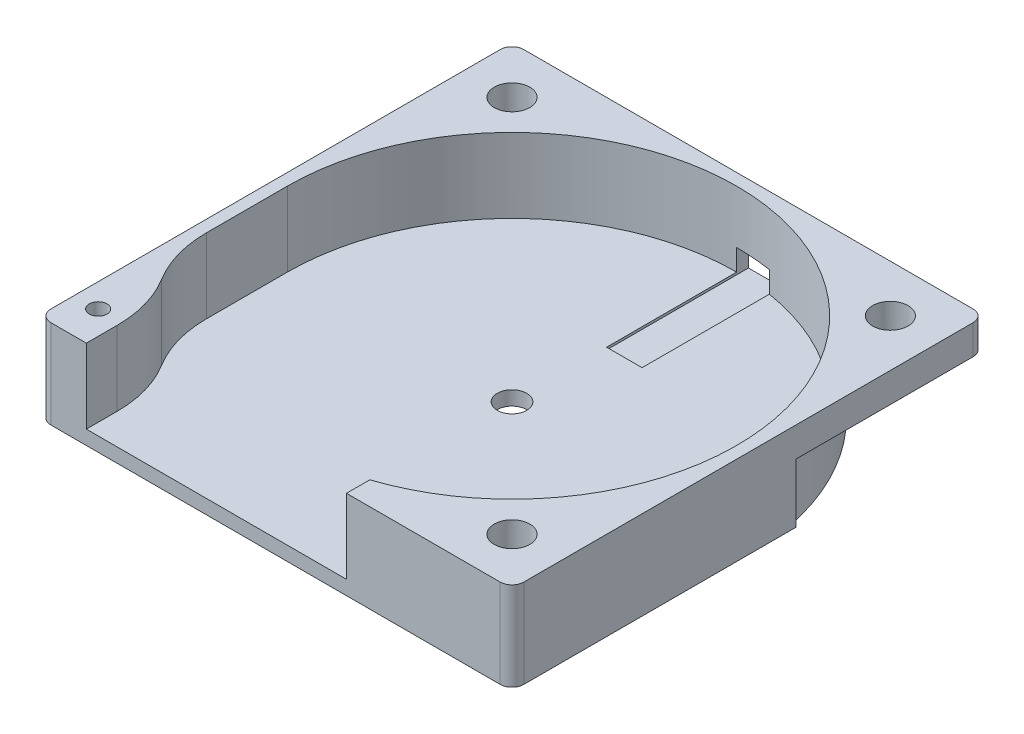
ISO-10303-21;
HEADER;
FILE_DESCRIPTION(('STEP AP214'),'2;1');
FILE_NAME('part.step','',(''),(''),'','','');
FILE_SCHEMA(('AUTOMOTIVE_DESIGN { 1 0 10303 214 1 1 1 1 }'));
ENDSEC;
DATA;
#1=APPLICATION_CONTEXT('core data for automotive mechanical design processes');
#2=APPLICATION_PROTOCOL_DEFINITION('international standard','automotive_design',2000,#1);
#3=PRODUCT_CONTEXT('',#1,'mechanical');
#4=PRODUCT('Part','Part','',(#3));
#5=PRODUCT_RELATED_PRODUCT_CATEGORY('part','',(#4));
#6=PRODUCT_DEFINITION_FORMATION('','',#4);
#7=PRODUCT_DEFINITION_CONTEXT('part definition',#1,'design');
#8=PRODUCT_DEFINITION('design','',#6,#7);
#9=PRODUCT_DEFINITION_SHAPE('','',#8);
#10=(LENGTH_UNIT() NAMED_UNIT(*) SI_UNIT(.MILLI.,.METRE.));
#11=(NAMED_UNIT(*) PLANE_ANGLE_UNIT() SI_UNIT($,.RADIAN.));
#12=(NAMED_UNIT(*) SI_UNIT($,.STERADIAN.) SOLID_ANGLE_UNIT());
#13=UNCERTAINTY_MEASURE_WITH_UNIT(LENGTH_MEASURE(1.E-05),#10,'distance_accuracy_value','');
#14=(GEOMETRIC_REPRESENTATION_CONTEXT(3) GLOBAL_UNCERTAINTY_ASSIGNED_CONTEXT((#13)) GLOBAL_UNIT_ASSIGNED_CONTEXT((#10,
#11,#12)) REPRESENTATION_CONTEXT('',''));
#15=CARTESIAN_POINT('',(0.,0.,0.));
#16=DIRECTION('',(0.,0.,1.));
#17=DIRECTION('',(1.,0.,0.));
#18=AXIS2_PLACEMENT_3D('',#15,#16,#17);
#19=CARTESIAN_POINT('',(-20.,7.5,-20.));
#20=DIRECTION('',(0.,0.,1.));
#21=DIRECTION('',(1.,0.,0.));
#22=AXIS2_PLACEMENT_3D('',#19,#20,#21);
#23=PLANE('',#22);
#24=DIRECTION('',(1.,0.,0.));
#25=VECTOR('',#24,1.);
#26=CARTESIAN_POINT('',(0.,3.,-20.));
#27=LINE('',#26,#25);
#28=CARTESIAN_POINT('',(0.,3.,-20.));
#29=VERTEX_POINT('',#28);
#30=CARTESIAN_POINT('',(3.,3.,-20.));
#31=VERTEX_POINT('',#30);
#32=EDGE_CURVE('E321',#29,#31,#27,.T.);
#33=ORIENTED_EDGE('',*,*,#32,.F.);
#34=DIRECTION('',(0.,-1.,0.));
#35=VECTOR('',#34,1.);
#36=CARTESIAN_POINT('',(0.,3.,-20.));
#37=LINE('',#36,#35);
#38=CARTESIAN_POINT('',(0.,1.,-20.));
#39=VERTEX_POINT('',#38);
#40=EDGE_CURVE('E327',#29,#39,#37,.T.);
#41=ORIENTED_EDGE('',*,*,#40,.T.);
#42=DIRECTION('',(1.,0.,0.));
#43=VECTOR('',#42,1.);
#44=CARTESIAN_POINT('',(0.,1.,-20.));
#45=LINE('',#44,#43);
#46=CARTESIAN_POINT('',(3.,1.,-20.));
#47=VERTEX_POINT('',#46);
#48=EDGE_CURVE('E330',#39,#47,#45,.T.);
#49=ORIENTED_EDGE('',*,*,#48,.T.);
#50=DIRECTION('',(0.,-1.,0.));
#51=VECTOR('',#50,1.);
#52=CARTESIAN_POINT('',(3.,3.,-20.));
#53=LINE('',#52,#51);
#54=EDGE_CURVE('E343',#31,#47,#53,.T.);
#55=ORIENTED_EDGE('',*,*,#54,.F.);
#56=EDGE_LOOP('',(#33,#41,#49,#55));
#57=FACE_BOUND('',#56,.T.);
#58=DIRECTION('',(0.,-1.,0.));
#59=VECTOR('',#58,1.);
#60=CARTESIAN_POINT('',(4.,5.,-20.));
#61=LINE('',#60,#59);
#62=CARTESIAN_POINT('',(4.,5.,-20.));
#63=VERTEX_POINT('',#62);
#64=CARTESIAN_POINT('',(4.,0.,-20.));
#65=VERTEX_POINT('',#64);
#66=EDGE_CURVE('E238',#63,#65,#61,.T.);
#67=ORIENTED_EDGE('',*,*,#66,.T.);
#68=DIRECTION('',(-1.,0.,0.));
#69=VECTOR('',#68,1.);
#70=CARTESIAN_POINT('',(-20.,0.,-20.));
#71=LINE('',#70,#69);
#72=CARTESIAN_POINT('',(-4.,0.,-20.));
#73=VERTEX_POINT('',#72);
#74=EDGE_CURVE('E418',#65,#73,#71,.T.);
#75=ORIENTED_EDGE('',*,*,#74,.T.);
#76=DIRECTION('',(0.,-1.,0.));
#77=VECTOR('',#76,1.);
#78=CARTESIAN_POINT('',(-4.,5.,-20.));
#79=LINE('',#78,#77);
#80=CARTESIAN_POINT('',(-4.,5.,-20.));
#81=VERTEX_POINT('',#80);
#82=EDGE_CURVE('E304',#81,#73,#79,.T.);
#83=ORIENTED_EDGE('',*,*,#82,.F.);
#84=DIRECTION('',(1.,0.,0.));
#85=VECTOR('',#84,1.);
#86=CARTESIAN_POINT('',(0.,5.,-20.));
#87=LINE('',#86,#85);
#88=CARTESIAN_POINT('',(-19.,5.,-20.));
#89=VERTEX_POINT('',#88);
#90=EDGE_CURVE('E287',#89,#81,#87,.T.);
#91=ORIENTED_EDGE('',*,*,#90,.F.);
#92=DIRECTION('',(0.,-1.,0.));
#93=VECTOR('',#92,1.);
#94=CARTESIAN_POINT('',(-19.,7.5,-20.));
#95=LINE('',#94,#93);
#96=CARTESIAN_POINT('',(-19.,7.5,-20.));
#97=VERTEX_POINT('',#96);
#98=EDGE_CURVE('E469',#89,#97,#95,.F.);
#99=ORIENTED_EDGE('',*,*,#98,.T.);
#100=DIRECTION('',(-1.,0.,0.));
#101=VECTOR('',#100,1.);
#102=CARTESIAN_POINT('',(-20.,7.5,-20.));
#103=LINE('',#102,#101);
#104=CARTESIAN_POINT('',(19.,7.5,-20.));
#105=VERTEX_POINT('',#104);
#106=EDGE_CURVE('E405',#105,#97,#103,.T.);
#107=ORIENTED_EDGE('',*,*,#106,.F.);
#108=DIRECTION('',(0.,-1.,0.));
#109=VECTOR('',#108,1.);
#110=CARTESIAN_POINT('',(19.,7.5,-20.));
#111=LINE('',#110,#109);
#112=CARTESIAN_POINT('',(19.,5.,-20.));
#113=VERTEX_POINT('',#112);
#114=EDGE_CURVE('E466',#105,#113,#111,.T.);
#115=ORIENTED_EDGE('',*,*,#114,.T.);
#116=DIRECTION('',(1.,0.,0.));
#117=VECTOR('',#116,1.);
#118=CARTESIAN_POINT('',(0.,5.,-20.));
#119=LINE('',#118,#117);
#120=EDGE_CURVE('E64',#63,#113,#119,.T.);
#121=ORIENTED_EDGE('',*,*,#120,.F.);
#122=EDGE_LOOP('',(#67,#75,#83,#91,#99,#107,#115,#121));
#123=FACE_BOUND('',#122,.T.);
#124=ADVANCED_FACE('F41',(#57,#123),#23,.F.);
#125=CARTESIAN_POINT('',(20.,7.5,20.));
#126=DIRECTION('',(-1.,0.,0.));
#127=DIRECTION('',(0.,0.,1.));
#128=AXIS2_PLACEMENT_3D('',#125,#126,#127);
#129=PLANE('',#128);
#130=DIRECTION('',(0.,-1.,0.));
#131=VECTOR('',#130,1.);
#132=CARTESIAN_POINT('',(20.,5.,-3.99999999999999));
#133=LINE('',#132,#131);
#134=CARTESIAN_POINT('',(20.,5.,-3.99999999999999));
#135=VERTEX_POINT('',#134);
#136=CARTESIAN_POINT('',(20.,0.,-3.99999999999999));
#137=VERTEX_POINT('',#136);
#138=EDGE_CURVE('E276',#135,#137,#133,.T.);
#139=ORIENTED_EDGE('',*,*,#138,.F.);
#140=DIRECTION('',(0.,0.,1.));
#141=VECTOR('',#140,1.);
#142=CARTESIAN_POINT('',(20.,5.,0.));
#143=LINE('',#142,#141);
#144=CARTESIAN_POINT('',(20.,5.,-19.));
#145=VERTEX_POINT('',#144);
#146=EDGE_CURVE('E265',#145,#135,#143,.T.);
#147=ORIENTED_EDGE('',*,*,#146,.F.);
#148=DIRECTION('',(0.,-1.,0.));
#149=VECTOR('',#148,1.);
#150=CARTESIAN_POINT('',(20.,7.5,-19.));
#151=LINE('',#150,#149);
#152=CARTESIAN_POINT('',(20.,7.5,-19.));
#153=VERTEX_POINT('',#152);
#154=EDGE_CURVE('E474',#145,#153,#151,.F.);
#155=ORIENTED_EDGE('',*,*,#154,.T.);
#156=DIRECTION('',(0.,0.,-1.));
#157=VECTOR('',#156,1.);
#158=CARTESIAN_POINT('',(20.,7.5,20.));
#159=LINE('',#158,#157);
#160=CARTESIAN_POINT('',(20.,7.5,19.));
#161=VERTEX_POINT('',#160);
#162=EDGE_CURVE('E402',#161,#153,#159,.T.);
#163=ORIENTED_EDGE('',*,*,#162,.F.);
#164=DIRECTION('',(0.,-1.,0.));
#165=VECTOR('',#164,1.);
#166=CARTESIAN_POINT('',(20.,7.5,19.));
#167=LINE('',#166,#165);
#168=CARTESIAN_POINT('',(20.,0.,19.));
#169=VERTEX_POINT('',#168);
#170=EDGE_CURVE('E471',#161,#169,#167,.T.);
#171=ORIENTED_EDGE('',*,*,#170,.T.);
#172=DIRECTION('',(0.,0.,-1.));
#173=VECTOR('',#172,1.);
#174=CARTESIAN_POINT('',(20.,0.,20.));
#175=LINE('',#174,#173);
#176=EDGE_CURVE('E401',#169,#137,#175,.T.);
#177=ORIENTED_EDGE('',*,*,#176,.T.);
#178=EDGE_LOOP('',(#139,#147,#155,#163,#171,#177));
#179=FACE_BOUND('',#178,.T.);
#180=ADVANCED_FACE('F552',(#179),#129,.F.);
#181=CARTESIAN_POINT('',(0.,0.,0.));
#182=DIRECTION('',(0.,-1.,0.));
#183=DIRECTION('',(0.,0.,-1.));
#184=AXIS2_PLACEMENT_3D('',#181,#182,#183);
#185=PLANE('',#184);
#186=CARTESIAN_POINT('',(16.,0.,16.));
#187=DIRECTION('',(0.,1.,0.));
#188=DIRECTION('',(0.,0.,1.));
#189=AXIS2_PLACEMENT_3D('',#186,#187,#188);
#190=CIRCLE('',#189,1.5);
#191=CARTESIAN_POINT('',(16.,0.,17.5));
#192=VERTEX_POINT('',#191);
#193=EDGE_CURVE('E378',#192,#192,#190,.T.);
#194=ORIENTED_EDGE('',*,*,#193,.T.);
#195=EDGE_LOOP('',(#194));
#196=FACE_BOUND('',#195,.T.);
#197=CARTESIAN_POINT('',(0.,0.,0.));
#198=DIRECTION('',(0.,1.,0.));
#199=DIRECTION('',(0.,0.,1.));
#200=AXIS2_PLACEMENT_3D('',#197,#198,#199);
#201=CIRCLE('',#200,1.25);
#202=CARTESIAN_POINT('',(0.,0.,1.25));
#203=VERTEX_POINT('',#202);
#204=EDGE_CURVE('E365',#203,#203,#201,.T.);
#205=ORIENTED_EDGE('',*,*,#204,.T.);
#206=EDGE_LOOP('',(#205));
#207=FACE_BOUND('',#206,.T.);
#208=CARTESIAN_POINT('',(-18.,0.,17.));
#209=DIRECTION('',(0.,1.,0.));
#210=DIRECTION('',(0.,0.,1.));
#211=AXIS2_PLACEMENT_3D('',#208,#209,#210);
#212=CIRCLE('',#211,0.750000000000002);
#213=CARTESIAN_POINT('',(-18.,0.,17.75));
#214=VERTEX_POINT('',#213);
#215=EDGE_CURVE('E354',#214,#214,#212,.T.);
#216=ORIENTED_EDGE('',*,*,#215,.T.);
#217=EDGE_LOOP('',(#216));
#218=FACE_BOUND('',#217,.T.);
#219=CARTESIAN_POINT('',(0.,0.,0.));
#220=DIRECTION('',(0.,-1.,0.));
#221=DIRECTION('',(0.,0.,-1.));
#222=AXIS2_PLACEMENT_3D('',#219,#220,#221);
#223=CIRCLE('',#222,20.);
#224=CARTESIAN_POINT('',(4.,0.,-19.5959179422654));
#225=VERTEX_POINT('',#224);
#226=CARTESIAN_POINT('',(19.5959179422654,0.,-3.99999999999999));
#227=VERTEX_POINT('',#226);
#228=EDGE_CURVE('E248',#225,#227,#223,.T.);
#229=ORIENTED_EDGE('',*,*,#228,.T.);
#230=DIRECTION('',(1.,0.,0.));
#231=VECTOR('',#230,1.);
#232=CARTESIAN_POINT('',(0.,0.,-4.00000000000002));
#233=LINE('',#232,#231);
#234=EDGE_CURVE('E256',#227,#137,#233,.T.);
#235=ORIENTED_EDGE('',*,*,#234,.T.);
#236=ORIENTED_EDGE('',*,*,#176,.F.);
#237=CARTESIAN_POINT('',(19.,0.,19.));
#238=DIRECTION('',(0.,-1.,0.));
#239=DIRECTION('',(0.,0.,-1.));
#240=AXIS2_PLACEMENT_3D('',#237,#238,#239);
#241=CIRCLE('',#240,1.);
#242=CARTESIAN_POINT('',(19.,0.,20.));
#243=VERTEX_POINT('',#242);
#244=EDGE_CURVE('E448',#169,#243,#241,.T.);
#245=ORIENTED_EDGE('',*,*,#244,.T.);
#246=DIRECTION('',(1.,0.,0.));
#247=VECTOR('',#246,1.);
#248=CARTESIAN_POINT('',(-20.,0.,20.));
#249=LINE('',#248,#247);
#250=CARTESIAN_POINT('',(-19.,0.,20.));
#251=VERTEX_POINT('',#250);
#252=EDGE_CURVE('E406',#251,#243,#249,.T.);
#253=ORIENTED_EDGE('',*,*,#252,.F.);
#254=CARTESIAN_POINT('',(-19.,0.,19.));
#255=DIRECTION('',(0.,-1.,0.));
#256=DIRECTION('',(0.,0.,-1.));
#257=AXIS2_PLACEMENT_3D('',#254,#255,#256);
#258=CIRCLE('',#257,1.);
#259=CARTESIAN_POINT('',(-20.,0.,19.));
#260=VERTEX_POINT('',#259);
#261=EDGE_CURVE('E450',#251,#260,#258,.T.);
#262=ORIENTED_EDGE('',*,*,#261,.T.);
#263=DIRECTION('',(0.,0.,1.));
#264=VECTOR('',#263,1.);
#265=CARTESIAN_POINT('',(-20.,0.,20.));
#266=LINE('',#265,#264);
#267=CARTESIAN_POINT('',(-20.,0.,-3.99999999999999));
#268=VERTEX_POINT('',#267);
#269=EDGE_CURVE('E421',#268,#260,#266,.T.);
#270=ORIENTED_EDGE('',*,*,#269,.F.);
#271=DIRECTION('',(-1.,0.,0.));
#272=VECTOR('',#271,1.);
#273=CARTESIAN_POINT('',(0.,0.,-4.00000000000002));
#274=LINE('',#273,#272);
#275=CARTESIAN_POINT('',(-19.5959179422654,0.,-3.99999999999999));
#276=VERTEX_POINT('',#275);
#277=EDGE_CURVE('E299',#276,#268,#274,.T.);
#278=ORIENTED_EDGE('',*,*,#277,.F.);
#279=CARTESIAN_POINT('',(0.,0.,0.));
#280=DIRECTION('',(0.,-1.,0.));
#281=DIRECTION('',(0.,0.,-1.));
#282=AXIS2_PLACEMENT_3D('',#279,#280,#281);
#283=CIRCLE('',#282,20.);
#284=CARTESIAN_POINT('',(-4.,0.,-19.5959179422654));
#285=VERTEX_POINT('',#284);
#286=EDGE_CURVE('E296',#276,#285,#283,.T.);
#287=ORIENTED_EDGE('',*,*,#286,.T.);
#288=DIRECTION('',(0.,0.,1.));
#289=VECTOR('',#288,1.);
#290=CARTESIAN_POINT('',(-4.00000000000005,0.,0.));
#291=LINE('',#290,#289);
#292=EDGE_CURVE('E282',#73,#285,#291,.T.);
#293=ORIENTED_EDGE('',*,*,#292,.F.);
#294=ORIENTED_EDGE('',*,*,#74,.F.);
#295=DIRECTION('',(0.,0.,1.));
#296=VECTOR('',#295,1.);
#297=CARTESIAN_POINT('',(4.,0.,0.));
#298=LINE('',#297,#296);
#299=EDGE_CURVE('E259',#65,#225,#298,.T.);
#300=ORIENTED_EDGE('',*,*,#299,.T.);
#301=EDGE_LOOP('',(#229,#235,#236,#245,#253,#262,#270,#278,#287,#293,#294,#300));
#302=FACE_BOUND('',#301,.T.);
#303=ADVANCED_FACE('F554',(#196,#207,#218,#302),#185,.T.);
#304=CARTESIAN_POINT('',(16.,0.,-16.));
#305=DIRECTION('',(0.,1.,0.));
#306=DIRECTION('',(0.,0.,1.));
#307=AXIS2_PLACEMENT_3D('',#304,#305,#306);
#308=CYLINDRICAL_SURFACE('',#307,1.5);
#309=CARTESIAN_POINT('',(16.,7.5,-16.));
#310=DIRECTION('',(0.,1.,0.));
#311=DIRECTION('',(0.,0.,1.));
#312=AXIS2_PLACEMENT_3D('',#309,#310,#311);
#313=CIRCLE('',#312,1.5);
#314=CARTESIAN_POINT('',(16.,7.5,-14.5));
#315=VERTEX_POINT('',#314);
#316=EDGE_CURVE('E375',#315,#315,#313,.T.);
#317=ORIENTED_EDGE('',*,*,#316,.T.);
#318=EDGE_LOOP('',(#317));
#319=FACE_BOUND('',#318,.T.);
#320=CARTESIAN_POINT('',(16.,5.,-16.));
#321=DIRECTION('',(0.,-1.,0.));
#322=DIRECTION('',(0.,0.,-1.));
#323=AXIS2_PLACEMENT_3D('',#320,#321,#322);
#324=CIRCLE('',#323,1.5);
#325=CARTESIAN_POINT('',(16.,5.,-17.5));
#326=VERTEX_POINT('',#325);
#327=EDGE_CURVE('E250',#326,#326,#324,.F.);
#328=ORIENTED_EDGE('',*,*,#327,.F.);
#329=EDGE_LOOP('',(#328));
#330=FACE_BOUND('',#329,.T.);
#331=ADVANCED_FACE('F601',(#319,#330),#308,.F.);
#332=CARTESIAN_POINT('',(-16.,0.,-16.));
#333=DIRECTION('',(0.,1.,0.));
#334=DIRECTION('',(0.,0.,1.));
#335=AXIS2_PLACEMENT_3D('',#332,#333,#334);
#336=CYLINDRICAL_SURFACE('',#335,1.5);
#337=CARTESIAN_POINT('',(-16.,7.5,-16.));
#338=DIRECTION('',(0.,1.,0.));
#339=DIRECTION('',(0.,0.,1.));
#340=AXIS2_PLACEMENT_3D('',#337,#338,#339);
#341=CIRCLE('',#340,1.5);
#342=CARTESIAN_POINT('',(-16.,7.5,-14.5));
#343=VERTEX_POINT('',#342);
#344=EDGE_CURVE('E371',#343,#343,#341,.T.);
#345=ORIENTED_EDGE('',*,*,#344,.T.);
#346=EDGE_LOOP('',(#345));
#347=FACE_BOUND('',#346,.T.);
#348=CARTESIAN_POINT('',(-16.,5.,-16.));
#349=DIRECTION('',(0.,-1.,0.));
#350=DIRECTION('',(0.,0.,-1.));
#351=AXIS2_PLACEMENT_3D('',#348,#349,#350);
#352=CIRCLE('',#351,1.5);
#353=CARTESIAN_POINT('',(-16.,5.,-17.5));
#354=VERTEX_POINT('',#353);
#355=EDGE_CURVE('E292',#354,#354,#352,.F.);
#356=ORIENTED_EDGE('',*,*,#355,.F.);
#357=EDGE_LOOP('',(#356));
#358=FACE_BOUND('',#357,.T.);
#359=ADVANCED_FACE('F599',(#347,#358),#336,.F.);
#360=CARTESIAN_POINT('',(-19.,7.5,-19.));
#361=DIRECTION('',(0.,-1.,0.));
#362=DIRECTION('',(0.,0.,-1.));
#363=AXIS2_PLACEMENT_3D('',#360,#361,#362);
#364=CYLINDRICAL_SURFACE('',#363,1.);
#365=ORIENTED_EDGE('',*,*,#98,.F.);
#366=CARTESIAN_POINT('',(-19.,5.,-19.));
#367=DIRECTION('',(0.,-1.,0.));
#368=DIRECTION('',(0.,0.,-1.));
#369=AXIS2_PLACEMENT_3D('',#366,#367,#368);
#370=CIRCLE('',#369,1.);
#371=CARTESIAN_POINT('',(-20.,5.,-19.));
#372=VERTEX_POINT('',#371);
#373=EDGE_CURVE('E285',#372,#89,#370,.T.);
#374=ORIENTED_EDGE('',*,*,#373,.F.);
#375=DIRECTION('',(0.,-1.,0.));
#376=VECTOR('',#375,1.);
#377=CARTESIAN_POINT('',(-20.,7.5,-19.));
#378=LINE('',#377,#376);
#379=CARTESIAN_POINT('',(-20.,7.5,-19.));
#380=VERTEX_POINT('',#379);
#381=EDGE_CURVE('E453',#380,#372,#378,.T.);
#382=ORIENTED_EDGE('',*,*,#381,.F.);
#383=CARTESIAN_POINT('',(-19.,7.5,-19.));
#384=DIRECTION('',(0.,-1.,0.));
#385=DIRECTION('',(0.,0.,-1.));
#386=AXIS2_PLACEMENT_3D('',#383,#384,#385);
#387=CIRCLE('',#386,1.);
#388=EDGE_CURVE('E462',#97,#380,#387,.F.);
#389=ORIENTED_EDGE('',*,*,#388,.F.);
#390=EDGE_LOOP('',(#365,#374,#382,#389));
#391=FACE_BOUND('',#390,.T.);
#392=ADVANCED_FACE('F569',(#391),#364,.T.);
#393=CARTESIAN_POINT('',(19.,7.5,-19.));
#394=DIRECTION('',(0.,-1.,0.));
#395=DIRECTION('',(0.,0.,-1.));
#396=AXIS2_PLACEMENT_3D('',#393,#394,#395);
#397=CYLINDRICAL_SURFACE('',#396,1.);
#398=ORIENTED_EDGE('',*,*,#154,.F.);
#399=CARTESIAN_POINT('',(19.,5.,-19.));
#400=DIRECTION('',(0.,-1.,0.));
#401=DIRECTION('',(0.,0.,-1.));
#402=AXIS2_PLACEMENT_3D('',#399,#400,#401);
#403=CIRCLE('',#402,1.);
#404=EDGE_CURVE('E263',#113,#145,#403,.T.);
#405=ORIENTED_EDGE('',*,*,#404,.F.);
#406=ORIENTED_EDGE('',*,*,#114,.F.);
#407=CARTESIAN_POINT('',(19.,7.5,-19.));
#408=DIRECTION('',(0.,-1.,0.));
#409=DIRECTION('',(0.,0.,-1.));
#410=AXIS2_PLACEMENT_3D('',#407,#408,#409);
#411=CIRCLE('',#410,1.);
#412=EDGE_CURVE('E460',#153,#105,#411,.F.);
#413=ORIENTED_EDGE('',*,*,#412,.F.);
#414=EDGE_LOOP('',(#398,#405,#406,#413));
#415=FACE_BOUND('',#414,.T.);
#416=ADVANCED_FACE('F561',(#415),#397,.T.);
#417=CARTESIAN_POINT('',(-20.,7.5,20.));
#418=DIRECTION('',(0.,0.,-1.));
#419=DIRECTION('',(-1.,0.,0.));
#420=AXIS2_PLACEMENT_3D('',#417,#418,#419);
#421=PLANE('',#420);
#422=ORIENTED_EDGE('',*,*,#252,.T.);
#423=DIRECTION('',(0.,-1.,0.));
#424=VECTOR('',#423,1.);
#425=CARTESIAN_POINT('',(19.,7.5,20.));
#426=LINE('',#425,#424);
#427=CARTESIAN_POINT('',(19.,7.5,20.));
#428=VERTEX_POINT('',#427);
#429=EDGE_CURVE('E476',#243,#428,#426,.F.);
#430=ORIENTED_EDGE('',*,*,#429,.T.);
#431=DIRECTION('',(1.,0.,0.));
#432=VECTOR('',#431,1.);
#433=CARTESIAN_POINT('',(-20.,7.5,20.));
#434=LINE('',#433,#432);
#435=CARTESIAN_POINT('',(6.00000000000001,7.5,20.));
#436=VERTEX_POINT('',#435);
#437=EDGE_CURVE('E412',#436,#428,#434,.T.);
#438=ORIENTED_EDGE('',*,*,#437,.F.);
#439=DIRECTION('',(0.,1.,0.));
#440=VECTOR('',#439,1.);
#441=CARTESIAN_POINT('',(6.00000000000001,-30.8156211871643,20.));
#442=LINE('',#441,#440);
#443=CARTESIAN_POINT('',(6.00000000000001,1.2,20.));
#444=VERTEX_POINT('',#443);
#445=EDGE_CURVE('E315',#444,#436,#442,.T.);
#446=ORIENTED_EDGE('',*,*,#445,.F.);
#447=DIRECTION('',(1.,0.,0.));
#448=VECTOR('',#447,1.);
#449=CARTESIAN_POINT('',(0.,1.2,20.));
#450=LINE('',#449,#448);
#451=CARTESIAN_POINT('',(-16.,1.2,20.));
#452=VERTEX_POINT('',#451);
#453=EDGE_CURVE('E312',#452,#444,#450,.T.);
#454=ORIENTED_EDGE('',*,*,#453,.F.);
#455=DIRECTION('',(0.,-1.,0.));
#456=VECTOR('',#455,1.);
#457=CARTESIAN_POINT('',(-16.,14.2082039324994,20.));
#458=LINE('',#457,#456);
#459=CARTESIAN_POINT('',(-16.,7.5,20.));
#460=VERTEX_POINT('',#459);
#461=EDGE_CURVE('E275',#460,#452,#458,.T.);
#462=ORIENTED_EDGE('',*,*,#461,.F.);
#463=CARTESIAN_POINT('',(-19.,7.5,20.));
#464=VERTEX_POINT('',#463);
#465=EDGE_CURVE('E413',#464,#460,#434,.T.);
#466=ORIENTED_EDGE('',*,*,#465,.F.);
#467=DIRECTION('',(0.,-1.,0.));
#468=VECTOR('',#467,1.);
#469=CARTESIAN_POINT('',(-19.,7.5,20.));
#470=LINE('',#469,#468);
#471=EDGE_CURVE('E445',#464,#251,#470,.T.);
#472=ORIENTED_EDGE('',*,*,#471,.T.);
#473=EDGE_LOOP('',(#422,#430,#438,#446,#454,#462,#466,#472));
#474=FACE_BOUND('',#473,.T.);
#475=ADVANCED_FACE('F543',(#474),#421,.F.);
#476=CARTESIAN_POINT('',(0.,1.2,0.));
#477=DIRECTION('',(0.,-1.,0.));
#478=DIRECTION('',(0.,0.,-1.));
#479=AXIS2_PLACEMENT_3D('',#476,#477,#478);
#480=PLANE('',#479);
#481=CARTESIAN_POINT('',(0.,1.2,0.));
#482=DIRECTION('',(0.,1.,0.));
#483=DIRECTION('',(0.,0.,1.));
#484=AXIS2_PLACEMENT_3D('',#481,#482,#483);
#485=CIRCLE('',#484,1.25);
#486=CARTESIAN_POINT('',(0.,1.2,1.25));
#487=VERTEX_POINT('',#486);
#488=EDGE_CURVE('E363',#487,#487,#485,.T.);
#489=ORIENTED_EDGE('',*,*,#488,.F.);
#490=EDGE_LOOP('',(#489));
#491=FACE_BOUND('',#490,.T.);
#492=DIRECTION('',(0.,0.,-1.));
#493=VECTOR('',#492,1.);
#494=CARTESIAN_POINT('',(-16.,1.2,20.));
#495=LINE('',#494,#493);
#496=CARTESIAN_POINT('',(-16.,1.2,17.3942253243099));
#497=VERTEX_POINT('',#496);
#498=EDGE_CURVE('E357',#452,#497,#495,.T.);
#499=ORIENTED_EDGE('',*,*,#498,.F.);
#500=ORIENTED_EDGE('',*,*,#453,.T.);
#501=DIRECTION('',(0.,0.,-1.));
#502=VECTOR('',#501,1.);
#503=CARTESIAN_POINT('',(6.,1.2,0.));
#504=LINE('',#503,#502);
#505=CARTESIAN_POINT('',(6.00000000000001,1.2,18.0277563773199));
#506=VERTEX_POINT('',#505);
#507=EDGE_CURVE('E385',#444,#506,#504,.T.);
#508=ORIENTED_EDGE('',*,*,#507,.T.);
#509=CARTESIAN_POINT('',(0.,1.2,0.));
#510=DIRECTION('',(0.,-1.,0.));
#511=DIRECTION('',(0.,0.,-1.));
#512=AXIS2_PLACEMENT_3D('',#509,#510,#511);
#513=CIRCLE('',#512,19.);
#514=CARTESIAN_POINT('',(3.,1.2,-18.7616630392937));
#515=VERTEX_POINT('',#514);
#516=EDGE_CURVE('E398',#506,#515,#513,.F.);
#517=ORIENTED_EDGE('',*,*,#516,.T.);
#518=DIRECTION('',(0.,0.,1.));
#519=VECTOR('',#518,1.);
#520=CARTESIAN_POINT('',(3.,1.2,0.));
#521=LINE('',#520,#519);
#522=CARTESIAN_POINT('',(3.,1.2,-8.));
#523=VERTEX_POINT('',#522);
#524=EDGE_CURVE('E340',#515,#523,#521,.T.);
#525=ORIENTED_EDGE('',*,*,#524,.T.);
#526=DIRECTION('',(-1.,0.,0.));
#527=VECTOR('',#526,1.);
#528=CARTESIAN_POINT('',(0.,1.2,-8.));
#529=LINE('',#528,#527);
#530=CARTESIAN_POINT('',(0.,1.2,-8.));
#531=VERTEX_POINT('',#530);
#532=EDGE_CURVE('E12',#523,#531,#529,.T.);
#533=ORIENTED_EDGE('',*,*,#532,.T.);
#534=DIRECTION('',(0.,0.,-1.));
#535=VECTOR('',#534,1.);
#536=CARTESIAN_POINT('',(0.,1.2,0.));
#537=LINE('',#536,#535);
#538=CARTESIAN_POINT('',(0.,1.2,-19.));
#539=VERTEX_POINT('',#538);
#540=EDGE_CURVE('E350',#531,#539,#537,.T.);
#541=ORIENTED_EDGE('',*,*,#540,.T.);
#542=CARTESIAN_POINT('',(-19.,1.2,0.));
#543=VERTEX_POINT('',#542);
#544=EDGE_CURVE('E397',#539,#543,#513,.F.);
#545=ORIENTED_EDGE('',*,*,#544,.T.);
#546=DIRECTION('',(0.,0.,1.));
#547=VECTOR('',#546,1.);
#548=CARTESIAN_POINT('',(-19.,1.2,0.));
#549=LINE('',#548,#547);
#550=CARTESIAN_POINT('',(-19.,1.2,6.85857157145715));
#551=VERTEX_POINT('',#550);
#552=EDGE_CURVE('E388',#543,#551,#549,.T.);
#553=ORIENTED_EDGE('',*,*,#552,.T.);
#554=CARTESIAN_POINT('',(-9.,1.2,6.85857157145715));
#555=DIRECTION('',(0.,-1.,0.));
#556=DIRECTION('',(0.,0.,-1.));
#557=AXIS2_PLACEMENT_3D('',#554,#555,#556);
#558=CIRCLE('',#557,10.);
#559=CARTESIAN_POINT('',(-17.5,1.2,12.1263984478835));
#560=VERTEX_POINT('',#559);
#561=EDGE_CURVE('E430',#551,#560,#558,.F.);
#562=ORIENTED_EDGE('',*,*,#561,.T.);
#563=CARTESIAN_POINT('',(-26.,1.2,17.3942253243099));
#564=DIRECTION('',(0.,-1.,0.));
#565=DIRECTION('',(0.,0.,-1.));
#566=AXIS2_PLACEMENT_3D('',#563,#564,#565);
#567=CIRCLE('',#566,10.);
#568=EDGE_CURVE('E442',#560,#497,#567,.T.);
#569=ORIENTED_EDGE('',*,*,#568,.T.);
#570=EDGE_LOOP('',(#499,#500,#508,#517,#525,#533,#541,#545,#553,#562,#569));
#571=FACE_BOUND('',#570,.T.);
#572=ADVANCED_FACE('F495',(#491,#571),#480,.F.);
#573=CARTESIAN_POINT('',(-19.,-30.8156211871643,0.));
#574=DIRECTION('',(-1.,0.,0.));
#575=DIRECTION('',(0.,0.,1.));
#576=AXIS2_PLACEMENT_3D('',#573,#574,#575);
#577=PLANE('',#576);
#578=DIRECTION('',(0.,0.,1.));
#579=VECTOR('',#578,1.);
#580=CARTESIAN_POINT('',(-19.,7.5,0.));
#581=LINE('',#580,#579);
#582=CARTESIAN_POINT('',(-19.,7.5,0.));
#583=VERTEX_POINT('',#582);
#584=CARTESIAN_POINT('',(-19.,7.5,6.85857157145715));
#585=VERTEX_POINT('',#584);
#586=EDGE_CURVE('E374',#583,#585,#581,.T.);
#587=ORIENTED_EDGE('',*,*,#586,.T.);
#588=DIRECTION('',(0.,-1.,0.));
#589=VECTOR('',#588,1.);
#590=CARTESIAN_POINT('',(-19.,-30.8156211871643,6.85857157145715));
#591=LINE('',#590,#589);
#592=EDGE_CURVE('E427',#585,#551,#591,.T.);
#593=ORIENTED_EDGE('',*,*,#592,.T.);
#594=ORIENTED_EDGE('',*,*,#552,.F.);
#595=DIRECTION('',(0.,1.,0.));
#596=VECTOR('',#595,1.);
#597=CARTESIAN_POINT('',(-19.,-30.8156211871643,0.));
#598=LINE('',#597,#596);
#599=EDGE_CURVE('E392',#543,#583,#598,.T.);
#600=ORIENTED_EDGE('',*,*,#599,.T.);
#601=EDGE_LOOP('',(#587,#593,#594,#600));
#602=FACE_BOUND('',#601,.T.);
#603=ADVANCED_FACE('F527',(#602),#577,.F.);
#604=CARTESIAN_POINT('',(-20.,7.5,20.));
#605=DIRECTION('',(1.,0.,0.));
#606=DIRECTION('',(0.,0.,-1.));
#607=AXIS2_PLACEMENT_3D('',#604,#605,#606);
#608=PLANE('',#607);
#609=DIRECTION('',(0.,0.,-1.));
#610=VECTOR('',#609,1.);
#611=CARTESIAN_POINT('',(-20.,5.,0.));
#612=LINE('',#611,#610);
#613=CARTESIAN_POINT('',(-20.,5.,-3.99999999999999));
#614=VERTEX_POINT('',#613);
#615=EDGE_CURVE('E56',#614,#372,#612,.T.);
#616=ORIENTED_EDGE('',*,*,#615,.F.);
#617=DIRECTION('',(0.,-1.,0.));
#618=VECTOR('',#617,1.);
#619=CARTESIAN_POINT('',(-20.,5.,-3.99999999999999));
#620=LINE('',#619,#618);
#621=EDGE_CURVE('E306',#614,#268,#620,.T.);
#622=ORIENTED_EDGE('',*,*,#621,.T.);
#623=ORIENTED_EDGE('',*,*,#269,.T.);
#624=DIRECTION('',(0.,-1.,0.));
#625=VECTOR('',#624,1.);
#626=CARTESIAN_POINT('',(-20.,7.5,19.));
#627=LINE('',#626,#625);
#628=CARTESIAN_POINT('',(-20.,7.5,19.));
#629=VERTEX_POINT('',#628);
#630=EDGE_CURVE('E456',#260,#629,#627,.F.);
#631=ORIENTED_EDGE('',*,*,#630,.T.);
#632=DIRECTION('',(0.,0.,1.));
#633=VECTOR('',#632,1.);
#634=CARTESIAN_POINT('',(-20.,7.5,20.));
#635=LINE('',#634,#633);
#636=EDGE_CURVE('E409',#380,#629,#635,.T.);
#637=ORIENTED_EDGE('',*,*,#636,.F.);
#638=ORIENTED_EDGE('',*,*,#381,.T.);
#639=EDGE_LOOP('',(#616,#622,#623,#631,#637,#638));
#640=FACE_BOUND('',#639,.T.);
#641=ADVANCED_FACE('F573',(#640),#608,.F.);
#642=CARTESIAN_POINT('',(0.,7.5,0.));
#643=DIRECTION('',(0.,-1.,0.));
#644=DIRECTION('',(0.,0.,-1.));
#645=AXIS2_PLACEMENT_3D('',#642,#643,#644);
#646=PLANE('',#645);
#647=CARTESIAN_POINT('',(-18.,7.5,17.));
#648=DIRECTION('',(0.,1.,0.));
#649=DIRECTION('',(0.,0.,1.));
#650=AXIS2_PLACEMENT_3D('',#647,#648,#649);
#651=CIRCLE('',#650,0.750000000000002);
#652=CARTESIAN_POINT('',(-18.,7.5,17.75));
#653=VERTEX_POINT('',#652);
#654=EDGE_CURVE('E353',#653,#653,#651,.T.);
#655=ORIENTED_EDGE('',*,*,#654,.F.);
#656=EDGE_LOOP('',(#655));
#657=FACE_BOUND('',#656,.T.);
#658=ORIENTED_EDGE('',*,*,#344,.F.);
#659=EDGE_LOOP('',(#658));
#660=FACE_BOUND('',#659,.T.);
#661=ORIENTED_EDGE('',*,*,#316,.F.);
#662=EDGE_LOOP('',(#661));
#663=FACE_BOUND('',#662,.T.);
#664=CARTESIAN_POINT('',(16.,7.5,16.));
#665=DIRECTION('',(0.,1.,0.));
#666=DIRECTION('',(0.,0.,1.));
#667=AXIS2_PLACEMENT_3D('',#664,#665,#666);
#668=CIRCLE('',#667,1.5);
#669=CARTESIAN_POINT('',(16.,7.5,17.5));
#670=VERTEX_POINT('',#669);
#671=EDGE_CURVE('E368',#670,#670,#668,.T.);
#672=ORIENTED_EDGE('',*,*,#671,.F.);
#673=EDGE_LOOP('',(#672));
#674=FACE_BOUND('',#673,.T.);
#675=ORIENTED_EDGE('',*,*,#465,.T.);
#676=DIRECTION('',(0.,0.,1.));
#677=VECTOR('',#676,1.);
#678=CARTESIAN_POINT('',(-16.,7.5,20.));
#679=LINE('',#678,#677);
#680=CARTESIAN_POINT('',(-16.,7.5,17.3942253243099));
#681=VERTEX_POINT('',#680);
#682=EDGE_CURVE('E360',#681,#460,#679,.T.);
#683=ORIENTED_EDGE('',*,*,#682,.F.);
#684=CARTESIAN_POINT('',(-26.,7.5,17.3942253243099));
#685=DIRECTION('',(0.,-1.,0.));
#686=DIRECTION('',(0.,0.,-1.));
#687=AXIS2_PLACEMENT_3D('',#684,#685,#686);
#688=CIRCLE('',#687,10.);
#689=CARTESIAN_POINT('',(-17.5,7.5,12.1263984478835));
#690=VERTEX_POINT('',#689);
#691=EDGE_CURVE('E440',#681,#690,#688,.F.);
#692=ORIENTED_EDGE('',*,*,#691,.T.);
#693=CARTESIAN_POINT('',(-9.,7.5,6.85857157145715));
#694=DIRECTION('',(0.,-1.,0.));
#695=DIRECTION('',(0.,0.,-1.));
#696=AXIS2_PLACEMENT_3D('',#693,#694,#695);
#697=CIRCLE('',#696,10.);
#698=EDGE_CURVE('E433',#690,#585,#697,.T.);
#699=ORIENTED_EDGE('',*,*,#698,.T.);
#700=ORIENTED_EDGE('',*,*,#586,.F.);
#701=CARTESIAN_POINT('',(0.,7.5,0.));
#702=DIRECTION('',(0.,1.,0.));
#703=DIRECTION('',(0.,0.,1.));
#704=AXIS2_PLACEMENT_3D('',#701,#702,#703);
#705=CIRCLE('',#704,19.);
#706=CARTESIAN_POINT('',(6.00000000000001,7.5,18.0277563773199));
#707=VERTEX_POINT('',#706);
#708=EDGE_CURVE('E391',#707,#583,#705,.T.);
#709=ORIENTED_EDGE('',*,*,#708,.F.);
#710=DIRECTION('',(0.,0.,-1.));
#711=VECTOR('',#710,1.);
#712=CARTESIAN_POINT('',(6.,7.5,0.));
#713=LINE('',#712,#711);
#714=EDGE_CURVE('E383',#436,#707,#713,.T.);
#715=ORIENTED_EDGE('',*,*,#714,.F.);
#716=ORIENTED_EDGE('',*,*,#437,.T.);
#717=CARTESIAN_POINT('',(19.,7.5,19.));
#718=DIRECTION('',(0.,-1.,0.));
#719=DIRECTION('',(0.,0.,-1.));
#720=AXIS2_PLACEMENT_3D('',#717,#718,#719);
#721=CIRCLE('',#720,1.);
#722=EDGE_CURVE('E458',#428,#161,#721,.F.);
#723=ORIENTED_EDGE('',*,*,#722,.T.);
#724=ORIENTED_EDGE('',*,*,#162,.T.);
#725=ORIENTED_EDGE('',*,*,#412,.T.);
#726=ORIENTED_EDGE('',*,*,#106,.T.);
#727=ORIENTED_EDGE('',*,*,#388,.T.);
#728=ORIENTED_EDGE('',*,*,#636,.T.);
#729=CARTESIAN_POINT('',(-19.,7.5,19.));
#730=DIRECTION('',(0.,-1.,0.));
#731=DIRECTION('',(0.,0.,-1.));
#732=AXIS2_PLACEMENT_3D('',#729,#730,#731);
#733=CIRCLE('',#732,1.);
#734=EDGE_CURVE('E464',#629,#464,#733,.F.);
#735=ORIENTED_EDGE('',*,*,#734,.T.);
#736=EDGE_LOOP('',(#675,#683,#692,#699,#700,#709,#715,#716,#723,#724,#725,#726,#727,#728,#735));
#737=FACE_BOUND('',#736,.T.);
#738=ADVANCED_FACE('F522',(#657,#660,#663,#674,#737),#646,.F.);
#739=CARTESIAN_POINT('',(0.,-53.7401153701776,0.));
#740=DIRECTION('',(0.,1.,0.));
#741=DIRECTION('',(0.,0.,1.));
#742=AXIS2_PLACEMENT_3D('',#739,#740,#741);
#743=CYLINDRICAL_SURFACE('',#742,19.);
#744=ORIENTED_EDGE('',*,*,#544,.F.);
#745=DIRECTION('',(0.,1.,0.));
#746=VECTOR('',#745,1.);
#747=CARTESIAN_POINT('',(0.,-53.7401153701776,-19.));
#748=LINE('',#747,#746);
#749=CARTESIAN_POINT('',(0.,3.,-19.));
#750=VERTEX_POINT('',#749);
#751=EDGE_CURVE('E49',#539,#750,#748,.T.);
#752=ORIENTED_EDGE('',*,*,#751,.T.);
#753=CARTESIAN_POINT('',(0.,3.,0.));
#754=DIRECTION('',(0.,-1.,0.));
#755=DIRECTION('',(0.,0.,-1.));
#756=AXIS2_PLACEMENT_3D('',#753,#754,#755);
#757=CIRCLE('',#756,19.);
#758=CARTESIAN_POINT('',(3.,3.,-18.7616630392937));
#759=VERTEX_POINT('',#758);
#760=EDGE_CURVE('E478',#759,#750,#757,.F.);
#761=ORIENTED_EDGE('',*,*,#760,.F.);
#762=DIRECTION('',(0.,1.,0.));
#763=VECTOR('',#762,1.);
#764=CARTESIAN_POINT('',(3.,-53.7401153701776,-18.7616630392937));
#765=LINE('',#764,#763);
#766=EDGE_CURVE('E480',#759,#515,#765,.F.);
#767=ORIENTED_EDGE('',*,*,#766,.T.);
#768=ORIENTED_EDGE('',*,*,#516,.F.);
#769=DIRECTION('',(0.,1.,0.));
#770=VECTOR('',#769,1.);
#771=CARTESIAN_POINT('',(6.00000000000001,-53.7401153701776,18.0277563773199));
#772=LINE('',#771,#770);
#773=EDGE_CURVE('E415',#506,#707,#772,.T.);
#774=ORIENTED_EDGE('',*,*,#773,.T.);
#775=ORIENTED_EDGE('',*,*,#708,.T.);
#776=ORIENTED_EDGE('',*,*,#599,.F.);
#777=EDGE_LOOP('',(#744,#752,#761,#767,#768,#774,#775,#776));
#778=FACE_BOUND('',#777,.T.);
#779=ADVANCED_FACE('F486',(#778),#743,.F.);
#780=CARTESIAN_POINT('',(6.,-30.8156211871643,0.));
#781=DIRECTION('',(1.,0.,0.));
#782=DIRECTION('',(0.,0.,-1.));
#783=AXIS2_PLACEMENT_3D('',#780,#781,#782);
#784=PLANE('',#783);
#785=ORIENTED_EDGE('',*,*,#507,.F.);
#786=ORIENTED_EDGE('',*,*,#445,.T.);
#787=ORIENTED_EDGE('',*,*,#714,.T.);
#788=ORIENTED_EDGE('',*,*,#773,.F.);
#789=EDGE_LOOP('',(#785,#786,#787,#788));
#790=FACE_BOUND('',#789,.T.);
#791=ADVANCED_FACE('F517',(#790),#784,.F.);
#792=CARTESIAN_POINT('',(16.,0.,16.));
#793=DIRECTION('',(0.,1.,0.));
#794=DIRECTION('',(0.,0.,1.));
#795=AXIS2_PLACEMENT_3D('',#792,#793,#794);
#796=CYLINDRICAL_SURFACE('',#795,1.5);
#797=ORIENTED_EDGE('',*,*,#193,.F.);
#798=EDGE_LOOP('',(#797));
#799=FACE_BOUND('',#798,.T.);
#800=ORIENTED_EDGE('',*,*,#671,.T.);
#801=EDGE_LOOP('',(#800));
#802=FACE_BOUND('',#801,.T.);
#803=ADVANCED_FACE('F650',(#799,#802),#796,.F.);
#804=CARTESIAN_POINT('',(0.,0.,0.));
#805=DIRECTION('',(0.,1.,0.));
#806=DIRECTION('',(0.,0.,1.));
#807=AXIS2_PLACEMENT_3D('',#804,#805,#806);
#808=CYLINDRICAL_SURFACE('',#807,1.25);
#809=ORIENTED_EDGE('',*,*,#204,.F.);
#810=EDGE_LOOP('',(#809));
#811=FACE_BOUND('',#810,.T.);
#812=ORIENTED_EDGE('',*,*,#488,.T.);
#813=EDGE_LOOP('',(#812));
#814=FACE_BOUND('',#813,.T.);
#815=ADVANCED_FACE('F654',(#811,#814),#808,.F.);
#816=CARTESIAN_POINT('',(-16.,14.2082039324994,20.));
#817=DIRECTION('',(-1.,0.,0.));
#818=DIRECTION('',(0.,0.,1.));
#819=AXIS2_PLACEMENT_3D('',#816,#817,#818);
#820=PLANE('',#819);
#821=ORIENTED_EDGE('',*,*,#682,.T.);
#822=ORIENTED_EDGE('',*,*,#461,.T.);
#823=ORIENTED_EDGE('',*,*,#498,.T.);
#824=DIRECTION('',(0.,-1.,0.));
#825=VECTOR('',#824,1.);
#826=CARTESIAN_POINT('',(-16.,14.2082039324994,17.3942253243099));
#827=LINE('',#826,#825);
#828=EDGE_CURVE('E438',#497,#681,#827,.F.);
#829=ORIENTED_EDGE('',*,*,#828,.T.);
#830=EDGE_LOOP('',(#821,#822,#823,#829));
#831=FACE_BOUND('',#830,.T.);
#832=ADVANCED_FACE('F537',(#831),#820,.F.);
#833=CARTESIAN_POINT('',(-9.,14.2082039324994,6.85857157145715));
#834=DIRECTION('',(0.,-1.,0.));
#835=DIRECTION('',(0.,0.,-1.));
#836=AXIS2_PLACEMENT_3D('',#833,#834,#835);
#837=CYLINDRICAL_SURFACE('',#836,10.);
#838=ORIENTED_EDGE('',*,*,#698,.F.);
#839=DIRECTION('',(0.,-1.,0.));
#840=VECTOR('',#839,1.);
#841=CARTESIAN_POINT('',(-17.5,14.2082039324994,12.1263984478835));
#842=LINE('',#841,#840);
#843=EDGE_CURVE('E435',#690,#560,#842,.T.);
#844=ORIENTED_EDGE('',*,*,#843,.T.);
#845=ORIENTED_EDGE('',*,*,#561,.F.);
#846=ORIENTED_EDGE('',*,*,#592,.F.);
#847=EDGE_LOOP('',(#838,#844,#845,#846));
#848=FACE_BOUND('',#847,.T.);
#849=ADVANCED_FACE('F529',(#848),#837,.F.);
#850=CARTESIAN_POINT('',(-26.,14.2082039324994,17.3942253243099));
#851=DIRECTION('',(0.,-1.,0.));
#852=DIRECTION('',(0.,0.,-1.));
#853=AXIS2_PLACEMENT_3D('',#850,#851,#852);
#854=CYLINDRICAL_SURFACE('',#853,10.);
#855=ORIENTED_EDGE('',*,*,#691,.F.);
#856=ORIENTED_EDGE('',*,*,#828,.F.);
#857=ORIENTED_EDGE('',*,*,#568,.F.);
#858=ORIENTED_EDGE('',*,*,#843,.F.);
#859=EDGE_LOOP('',(#855,#856,#857,#858));
#860=FACE_BOUND('',#859,.T.);
#861=ADVANCED_FACE('F534',(#860),#854,.T.);
#862=CARTESIAN_POINT('',(-18.,0.,17.));
#863=DIRECTION('',(0.,1.,0.));
#864=DIRECTION('',(0.,0.,1.));
#865=AXIS2_PLACEMENT_3D('',#862,#863,#864);
#866=CYLINDRICAL_SURFACE('',#865,0.750000000000002);
#867=ORIENTED_EDGE('',*,*,#215,.F.);
#868=EDGE_LOOP('',(#867));
#869=FACE_BOUND('',#868,.T.);
#870=ORIENTED_EDGE('',*,*,#654,.T.);
#871=EDGE_LOOP('',(#870));
#872=FACE_BOUND('',#871,.T.);
#873=ADVANCED_FACE('F626',(#869,#872),#866,.F.);
#874=CARTESIAN_POINT('',(-19.,7.5,19.));
#875=DIRECTION('',(0.,-1.,0.));
#876=DIRECTION('',(0.,0.,-1.));
#877=AXIS2_PLACEMENT_3D('',#874,#875,#876);
#878=CYLINDRICAL_SURFACE('',#877,1.);
#879=ORIENTED_EDGE('',*,*,#734,.F.);
#880=ORIENTED_EDGE('',*,*,#630,.F.);
#881=ORIENTED_EDGE('',*,*,#261,.F.);
#882=ORIENTED_EDGE('',*,*,#471,.F.);
#883=EDGE_LOOP('',(#879,#880,#881,#882));
#884=FACE_BOUND('',#883,.T.);
#885=ADVANCED_FACE('F578',(#884),#878,.T.);
#886=CARTESIAN_POINT('',(19.,7.5,19.));
#887=DIRECTION('',(0.,-1.,0.));
#888=DIRECTION('',(0.,0.,-1.));
#889=AXIS2_PLACEMENT_3D('',#886,#887,#888);
#890=CYLINDRICAL_SURFACE('',#889,1.);
#891=ORIENTED_EDGE('',*,*,#722,.F.);
#892=ORIENTED_EDGE('',*,*,#429,.F.);
#893=ORIENTED_EDGE('',*,*,#244,.F.);
#894=ORIENTED_EDGE('',*,*,#170,.F.);
#895=EDGE_LOOP('',(#891,#892,#893,#894));
#896=FACE_BOUND('',#895,.T.);
#897=ADVANCED_FACE('F43',(#896),#890,.T.);
#898=CARTESIAN_POINT('',(0.,3.,-8.));
#899=DIRECTION('',(0.,0.,1.));
#900=DIRECTION('',(1.,0.,0.));
#901=AXIS2_PLACEMENT_3D('',#898,#899,#900);
#902=PLANE('',#901);
#903=DIRECTION('',(0.,-1.,0.));
#904=VECTOR('',#903,1.);
#905=CARTESIAN_POINT('',(3.,3.,-8.));
#906=LINE('',#905,#904);
#907=CARTESIAN_POINT('',(3.,1.,-8.));
#908=VERTEX_POINT('',#907);
#909=EDGE_CURVE('E341',#523,#908,#906,.T.);
#910=ORIENTED_EDGE('',*,*,#909,.T.);
#911=DIRECTION('',(-1.,0.,0.));
#912=VECTOR('',#911,1.);
#913=CARTESIAN_POINT('',(0.,1.,-8.));
#914=LINE('',#913,#912);
#915=CARTESIAN_POINT('',(0.,1.,-8.));
#916=VERTEX_POINT('',#915);
#917=EDGE_CURVE('E322',#908,#916,#914,.T.);
#918=ORIENTED_EDGE('',*,*,#917,.T.);
#919=DIRECTION('',(0.,-1.,0.));
#920=VECTOR('',#919,1.);
#921=CARTESIAN_POINT('',(0.,3.,-8.));
#922=LINE('',#921,#920);
#923=EDGE_CURVE('E338',#531,#916,#922,.T.);
#924=ORIENTED_EDGE('',*,*,#923,.F.);
#925=ORIENTED_EDGE('',*,*,#532,.F.);
#926=EDGE_LOOP('',(#910,#918,#924,#925));
#927=FACE_BOUND('',#926,.T.);
#928=ADVANCED_FACE('F499',(#927),#902,.F.);
#929=CARTESIAN_POINT('',(0.,3.,-8.));
#930=DIRECTION('',(-1.,0.,0.));
#931=DIRECTION('',(0.,0.,1.));
#932=AXIS2_PLACEMENT_3D('',#929,#930,#931);
#933=PLANE('',#932);
#934=ORIENTED_EDGE('',*,*,#923,.T.);
#935=DIRECTION('',(0.,0.,-1.));
#936=VECTOR('',#935,1.);
#937=CARTESIAN_POINT('',(0.,1.,-8.));
#938=LINE('',#937,#936);
#939=EDGE_CURVE('E318',#916,#39,#938,.T.);
#940=ORIENTED_EDGE('',*,*,#939,.T.);
#941=ORIENTED_EDGE('',*,*,#40,.F.);
#942=DIRECTION('',(0.,0.,-1.));
#943=VECTOR('',#942,1.);
#944=CARTESIAN_POINT('',(0.,3.,-8.));
#945=LINE('',#944,#943);
#946=EDGE_CURVE('E319',#750,#29,#945,.T.);
#947=ORIENTED_EDGE('',*,*,#946,.F.);
#948=ORIENTED_EDGE('',*,*,#751,.F.);
#949=ORIENTED_EDGE('',*,*,#540,.F.);
#950=EDGE_LOOP('',(#934,#940,#941,#947,#948,#949));
#951=FACE_BOUND('',#950,.T.);
#952=ADVANCED_FACE('F490',(#951),#933,.F.);
#953=CARTESIAN_POINT('',(3.,3.,-8.));
#954=DIRECTION('',(1.,0.,0.));
#955=DIRECTION('',(0.,0.,-1.));
#956=AXIS2_PLACEMENT_3D('',#953,#954,#955);
#957=PLANE('',#956);
#958=ORIENTED_EDGE('',*,*,#766,.F.);
#959=DIRECTION('',(0.,0.,1.));
#960=VECTOR('',#959,1.);
#961=CARTESIAN_POINT('',(3.,3.,-8.));
#962=LINE('',#961,#960);
#963=EDGE_CURVE('E325',#31,#759,#962,.T.);
#964=ORIENTED_EDGE('',*,*,#963,.F.);
#965=ORIENTED_EDGE('',*,*,#54,.T.);
#966=DIRECTION('',(0.,0.,1.));
#967=VECTOR('',#966,1.);
#968=CARTESIAN_POINT('',(3.,1.,-8.));
#969=LINE('',#968,#967);
#970=EDGE_CURVE('E333',#47,#908,#969,.T.);
#971=ORIENTED_EDGE('',*,*,#970,.T.);
#972=ORIENTED_EDGE('',*,*,#909,.F.);
#973=ORIENTED_EDGE('',*,*,#524,.F.);
#974=EDGE_LOOP('',(#958,#964,#965,#971,#972,#973));
#975=FACE_BOUND('',#974,.T.);
#976=ADVANCED_FACE('F502',(#975),#957,.F.);
#977=CARTESIAN_POINT('',(0.,3.,0.));
#978=DIRECTION('',(0.,-1.,0.));
#979=DIRECTION('',(0.,0.,-1.));
#980=AXIS2_PLACEMENT_3D('',#977,#978,#979);
#981=PLANE('',#980);
#982=ORIENTED_EDGE('',*,*,#760,.T.);
#983=ORIENTED_EDGE('',*,*,#946,.T.);
#984=ORIENTED_EDGE('',*,*,#32,.T.);
#985=ORIENTED_EDGE('',*,*,#963,.T.);
#986=EDGE_LOOP('',(#982,#983,#984,#985));
#987=FACE_BOUND('',#986,.T.);
#988=ADVANCED_FACE('F512',(#987),#981,.T.);
#989=CARTESIAN_POINT('',(0.,1.,0.));
#990=DIRECTION('',(0.,-1.,0.));
#991=DIRECTION('',(0.,0.,-1.));
#992=AXIS2_PLACEMENT_3D('',#989,#990,#991);
#993=PLANE('',#992);
#994=ORIENTED_EDGE('',*,*,#939,.F.);
#995=ORIENTED_EDGE('',*,*,#917,.F.);
#996=ORIENTED_EDGE('',*,*,#970,.F.);
#997=ORIENTED_EDGE('',*,*,#48,.F.);
#998=EDGE_LOOP('',(#994,#995,#996,#997));
#999=FACE_BOUND('',#998,.T.);
#1000=ADVANCED_FACE('F507',(#999),#993,.F.);
#1001=CARTESIAN_POINT('',(0.,5.,0.));
#1002=DIRECTION('',(0.,-1.,0.));
#1003=DIRECTION('',(0.,0.,-1.));
#1004=AXIS2_PLACEMENT_3D('',#1001,#1002,#1003);
#1005=CYLINDRICAL_SURFACE('',#1004,20.);
#1006=ORIENTED_EDGE('',*,*,#228,.F.);
#1007=DIRECTION('',(0.,-1.,0.));
#1008=VECTOR('',#1007,1.);
#1009=CARTESIAN_POINT('',(4.,5.,-19.5959179422654));
#1010=LINE('',#1009,#1008);
#1011=CARTESIAN_POINT('',(4.,5.,-19.5959179422654));
#1012=VERTEX_POINT('',#1011);
#1013=EDGE_CURVE('E235',#1012,#225,#1010,.T.);
#1014=ORIENTED_EDGE('',*,*,#1013,.F.);
#1015=CARTESIAN_POINT('',(0.,5.,0.));
#1016=DIRECTION('',(0.,-1.,0.));
#1017=DIRECTION('',(0.,0.,-1.));
#1018=AXIS2_PLACEMENT_3D('',#1015,#1016,#1017);
#1019=CIRCLE('',#1018,20.);
#1020=CARTESIAN_POINT('',(19.5959179422654,5.,-3.99999999999999));
#1021=VERTEX_POINT('',#1020);
#1022=EDGE_CURVE('E240',#1012,#1021,#1019,.T.);
#1023=ORIENTED_EDGE('',*,*,#1022,.T.);
#1024=DIRECTION('',(0.,-1.,0.));
#1025=VECTOR('',#1024,1.);
#1026=CARTESIAN_POINT('',(19.5959179422654,5.,-3.99999999999999));
#1027=LINE('',#1026,#1025);
#1028=EDGE_CURVE('E273',#1021,#227,#1027,.T.);
#1029=ORIENTED_EDGE('',*,*,#1028,.T.);
#1030=EDGE_LOOP('',(#1006,#1014,#1023,#1029));
#1031=FACE_BOUND('',#1030,.T.);
#1032=ADVANCED_FACE('F244',(#1031),#1005,.T.);
#1033=CARTESIAN_POINT('',(0.,5.,-4.00000000000002));
#1034=DIRECTION('',(0.,0.,-1.));
#1035=DIRECTION('',(-1.,0.,0.));
#1036=AXIS2_PLACEMENT_3D('',#1033,#1034,#1035);
#1037=PLANE('',#1036);
#1038=ORIENTED_EDGE('',*,*,#234,.F.);
#1039=ORIENTED_EDGE('',*,*,#1028,.F.);
#1040=DIRECTION('',(1.,0.,0.));
#1041=VECTOR('',#1040,1.);
#1042=CARTESIAN_POINT('',(0.,5.,-4.00000000000002));
#1043=LINE('',#1042,#1041);
#1044=EDGE_CURVE('E255',#1021,#135,#1043,.T.);
#1045=ORIENTED_EDGE('',*,*,#1044,.T.);
#1046=ORIENTED_EDGE('',*,*,#138,.T.);
#1047=EDGE_LOOP('',(#1038,#1039,#1045,#1046));
#1048=FACE_BOUND('',#1047,.T.);
#1049=ADVANCED_FACE('F556',(#1048),#1037,.T.);
#1050=CARTESIAN_POINT('',(4.,5.,0.));
#1051=DIRECTION('',(1.,0.,0.));
#1052=DIRECTION('',(0.,0.,-1.));
#1053=AXIS2_PLACEMENT_3D('',#1050,#1051,#1052);
#1054=PLANE('',#1053);
#1055=ORIENTED_EDGE('',*,*,#299,.F.);
#1056=ORIENTED_EDGE('',*,*,#66,.F.);
#1057=DIRECTION('',(0.,0.,1.));
#1058=VECTOR('',#1057,1.);
#1059=CARTESIAN_POINT('',(4.,5.,0.));
#1060=LINE('',#1059,#1058);
#1061=EDGE_CURVE('E232',#63,#1012,#1060,.T.);
#1062=ORIENTED_EDGE('',*,*,#1061,.T.);
#1063=ORIENTED_EDGE('',*,*,#1013,.T.);
#1064=EDGE_LOOP('',(#1055,#1056,#1062,#1063));
#1065=FACE_BOUND('',#1064,.T.);
#1066=ADVANCED_FACE('F234',(#1065),#1054,.T.);
#1067=CARTESIAN_POINT('',(0.,5.,0.));
#1068=DIRECTION('',(0.,-1.,0.));
#1069=DIRECTION('',(0.,0.,-1.));
#1070=AXIS2_PLACEMENT_3D('',#1067,#1068,#1069);
#1071=PLANE('',#1070);
#1072=ORIENTED_EDGE('',*,*,#1022,.F.);
#1073=ORIENTED_EDGE('',*,*,#1061,.F.);
#1074=ORIENTED_EDGE('',*,*,#120,.T.);
#1075=ORIENTED_EDGE('',*,*,#404,.T.);
#1076=ORIENTED_EDGE('',*,*,#146,.T.);
#1077=ORIENTED_EDGE('',*,*,#1044,.F.);
#1078=EDGE_LOOP('',(#1072,#1073,#1074,#1075,#1076,#1077));
#1079=FACE_BOUND('',#1078,.T.);
#1080=ORIENTED_EDGE('',*,*,#327,.T.);
#1081=EDGE_LOOP('',(#1080));
#1082=FACE_BOUND('',#1081,.T.);
#1083=ADVANCED_FACE('F252',(#1079,#1082),#1071,.T.);
#1084=CARTESIAN_POINT('',(0.,5.,0.));
#1085=DIRECTION('',(0.,-1.,0.));
#1086=DIRECTION('',(0.,0.,-1.));
#1087=AXIS2_PLACEMENT_3D('',#1084,#1085,#1086);
#1088=CYLINDRICAL_SURFACE('',#1087,20.);
#1089=ORIENTED_EDGE('',*,*,#286,.F.);
#1090=DIRECTION('',(0.,-1.,0.));
#1091=VECTOR('',#1090,1.);
#1092=CARTESIAN_POINT('',(-19.5959179422654,5.,-3.99999999999999));
#1093=LINE('',#1092,#1091);
#1094=CARTESIAN_POINT('',(-19.5959179422654,5.,-3.99999999999999));
#1095=VERTEX_POINT('',#1094);
#1096=EDGE_CURVE('E295',#1095,#276,#1093,.T.);
#1097=ORIENTED_EDGE('',*,*,#1096,.F.);
#1098=CARTESIAN_POINT('',(0.,5.,0.));
#1099=DIRECTION('',(0.,-1.,0.));
#1100=DIRECTION('',(0.,0.,-1.));
#1101=AXIS2_PLACEMENT_3D('',#1098,#1099,#1100);
#1102=CIRCLE('',#1101,20.);
#1103=CARTESIAN_POINT('',(-4.,5.,-19.5959179422654));
#1104=VERTEX_POINT('',#1103);
#1105=EDGE_CURVE('E279',#1095,#1104,#1102,.T.);
#1106=ORIENTED_EDGE('',*,*,#1105,.T.);
#1107=DIRECTION('',(0.,-1.,0.));
#1108=VECTOR('',#1107,1.);
#1109=CARTESIAN_POINT('',(-4.,5.,-19.5959179422654));
#1110=LINE('',#1109,#1108);
#1111=EDGE_CURVE('E271',#1104,#285,#1110,.T.);
#1112=ORIENTED_EDGE('',*,*,#1111,.T.);
#1113=EDGE_LOOP('',(#1089,#1097,#1106,#1112));
#1114=FACE_BOUND('',#1113,.T.);
#1115=ADVANCED_FACE('F587',(#1114),#1088,.T.);
#1116=CARTESIAN_POINT('',(-4.00000000000005,5.,0.));
#1117=DIRECTION('',(1.,0.,0.));
#1118=DIRECTION('',(0.,0.,-1.));
#1119=AXIS2_PLACEMENT_3D('',#1116,#1117,#1118);
#1120=PLANE('',#1119);
#1121=ORIENTED_EDGE('',*,*,#292,.T.);
#1122=ORIENTED_EDGE('',*,*,#1111,.F.);
#1123=DIRECTION('',(0.,0.,1.));
#1124=VECTOR('',#1123,1.);
#1125=CARTESIAN_POINT('',(-4.00000000000005,5.,0.));
#1126=LINE('',#1125,#1124);
#1127=EDGE_CURVE('E289',#81,#1104,#1126,.T.);
#1128=ORIENTED_EDGE('',*,*,#1127,.F.);
#1129=ORIENTED_EDGE('',*,*,#82,.T.);
#1130=EDGE_LOOP('',(#1121,#1122,#1128,#1129));
#1131=FACE_BOUND('',#1130,.T.);
#1132=ADVANCED_FACE('F591',(#1131),#1120,.F.);
#1133=CARTESIAN_POINT('',(0.,5.,-4.00000000000002));
#1134=DIRECTION('',(0.,0.,1.));
#1135=DIRECTION('',(1.,0.,0.));
#1136=AXIS2_PLACEMENT_3D('',#1133,#1134,#1135);
#1137=PLANE('',#1136);
#1138=ORIENTED_EDGE('',*,*,#277,.T.);
#1139=ORIENTED_EDGE('',*,*,#621,.F.);
#1140=DIRECTION('',(-1.,0.,0.));
#1141=VECTOR('',#1140,1.);
#1142=CARTESIAN_POINT('',(0.,5.,-4.00000000000002));
#1143=LINE('',#1142,#1141);
#1144=EDGE_CURVE('E281',#1095,#614,#1143,.T.);
#1145=ORIENTED_EDGE('',*,*,#1144,.F.);
#1146=ORIENTED_EDGE('',*,*,#1096,.T.);
#1147=EDGE_LOOP('',(#1138,#1139,#1145,#1146));
#1148=FACE_BOUND('',#1147,.T.);
#1149=ADVANCED_FACE('F583',(#1148),#1137,.F.);
#1150=CARTESIAN_POINT('',(0.,5.,0.));
#1151=DIRECTION('',(0.,-1.,0.));
#1152=DIRECTION('',(0.,0.,-1.));
#1153=AXIS2_PLACEMENT_3D('',#1150,#1151,#1152);
#1154=PLANE('',#1153);
#1155=ORIENTED_EDGE('',*,*,#1105,.F.);
#1156=ORIENTED_EDGE('',*,*,#1144,.T.);
#1157=ORIENTED_EDGE('',*,*,#615,.T.);
#1158=ORIENTED_EDGE('',*,*,#373,.T.);
#1159=ORIENTED_EDGE('',*,*,#90,.T.);
#1160=ORIENTED_EDGE('',*,*,#1127,.T.);
#1161=EDGE_LOOP('',(#1155,#1156,#1157,#1158,#1159,#1160));
#1162=FACE_BOUND('',#1161,.T.);
#1163=ORIENTED_EDGE('',*,*,#355,.T.);
#1164=EDGE_LOOP('',(#1163));
#1165=FACE_BOUND('',#1164,.T.);
#1166=ADVANCED_FACE('F593',(#1162,#1165),#1154,.T.);
#1167=CLOSED_SHELL('',(#124,#180,#303,#331,#359,#392,#416,#475,#572,#603,#641,#738,#779,#791,
#803,#815,#832,#849,#861,#873,#885,#897,#928,#952,#976,#988,#1000,#1032,#1049,#1066,#1083,#1115,
#1132,#1149,#1166));
#1168=MANIFOLD_SOLID_BREP('B2',#1167);
#1169=ADVANCED_BREP_SHAPE_REPRESENTATION('',(#18,#1168),#14);
#1170=SHAPE_DEFINITION_REPRESENTATION(#9,#1169);
ENDSEC;
END-ISO-10303-21;
